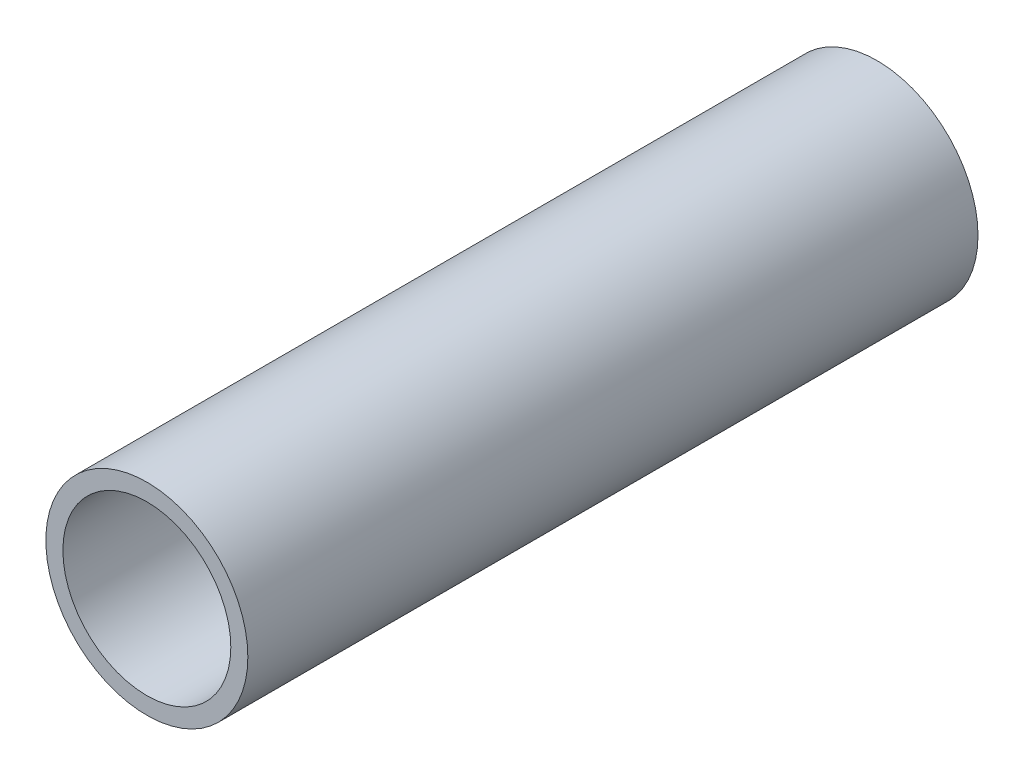
ISO-10303-21;
HEADER;
FILE_DESCRIPTION(('STEP AP214'),'2;1');
FILE_NAME('part.step','',(''),(''),'','','');
FILE_SCHEMA(('AUTOMOTIVE_DESIGN { 1 0 10303 214 1 1 1 1 }'));
ENDSEC;
DATA;
#1=APPLICATION_CONTEXT('core data for automotive mechanical design processes');
#2=APPLICATION_PROTOCOL_DEFINITION('international standard','automotive_design',2000,#1);
#3=PRODUCT_CONTEXT('',#1,'mechanical');
#4=PRODUCT('Part','Part','',(#3));
#5=PRODUCT_RELATED_PRODUCT_CATEGORY('part','',(#4));
#6=PRODUCT_DEFINITION_FORMATION('','',#4);
#7=PRODUCT_DEFINITION_CONTEXT('part definition',#1,'design');
#8=PRODUCT_DEFINITION('design','',#6,#7);
#9=PRODUCT_DEFINITION_SHAPE('','',#8);
#10=(LENGTH_UNIT() NAMED_UNIT(*) SI_UNIT(.MILLI.,.METRE.));
#11=(NAMED_UNIT(*) PLANE_ANGLE_UNIT() SI_UNIT($,.RADIAN.));
#12=(NAMED_UNIT(*) SI_UNIT($,.STERADIAN.) SOLID_ANGLE_UNIT());
#13=UNCERTAINTY_MEASURE_WITH_UNIT(LENGTH_MEASURE(1.E-05),#10,'distance_accuracy_value','');
#14=(GEOMETRIC_REPRESENTATION_CONTEXT(3) GLOBAL_UNCERTAINTY_ASSIGNED_CONTEXT((#13)) GLOBAL_UNIT_ASSIGNED_CONTEXT((#10,
#11,#12)) REPRESENTATION_CONTEXT('',''));
#15=CARTESIAN_POINT('',(0.,0.,0.));
#16=DIRECTION('',(0.,0.,1.));
#17=DIRECTION('',(1.,0.,0.));
#18=AXIS2_PLACEMENT_3D('',#15,#16,#17);
#19=CARTESIAN_POINT('',(0.,0.,152.4));
#20=DIRECTION('',(0.,0.,-1.));
#21=DIRECTION('',(-1.,0.,0.));
#22=AXIS2_PLACEMENT_3D('',#19,#20,#21);
#23=CYLINDRICAL_SURFACE('',#22,17.526);
#24=CARTESIAN_POINT('',(0.,0.,152.4));
#25=DIRECTION('',(0.,0.,1.));
#26=DIRECTION('',(1.,0.,0.));
#27=AXIS2_PLACEMENT_3D('',#24,#25,#26);
#28=CIRCLE('',#27,17.526);
#29=CARTESIAN_POINT('',(17.526,0.,152.4));
#30=VERTEX_POINT('',#29);
#31=EDGE_CURVE('E20',#30,#30,#28,.T.);
#32=ORIENTED_EDGE('',*,*,#31,.T.);
#33=EDGE_LOOP('',(#32));
#34=FACE_BOUND('',#33,.T.);
#35=CARTESIAN_POINT('',(0.,0.,0.));
#36=DIRECTION('',(0.,0.,1.));
#37=DIRECTION('',(1.,0.,0.));
#38=AXIS2_PLACEMENT_3D('',#35,#36,#37);
#39=CIRCLE('',#38,17.526);
#40=CARTESIAN_POINT('',(17.526,0.,0.));
#41=VERTEX_POINT('',#40);
#42=EDGE_CURVE('E31',#41,#41,#39,.T.);
#43=ORIENTED_EDGE('',*,*,#42,.F.);
#44=EDGE_LOOP('',(#43));
#45=FACE_BOUND('',#44,.T.);
#46=ADVANCED_FACE('F12',(#34,#45),#23,.F.);
#47=CARTESIAN_POINT('',(0.,0.,152.4));
#48=DIRECTION('',(0.,0.,-1.));
#49=DIRECTION('',(-1.,0.,0.));
#50=AXIS2_PLACEMENT_3D('',#47,#48,#49);
#51=CYLINDRICAL_SURFACE('',#50,21.082);
#52=CARTESIAN_POINT('',(0.,0.,152.4));
#53=DIRECTION('',(0.,0.,1.));
#54=DIRECTION('',(1.,0.,0.));
#55=AXIS2_PLACEMENT_3D('',#52,#53,#54);
#56=CIRCLE('',#55,21.082);
#57=CARTESIAN_POINT('',(21.082,0.,152.4));
#58=VERTEX_POINT('',#57);
#59=EDGE_CURVE('E8',#58,#58,#56,.T.);
#60=ORIENTED_EDGE('',*,*,#59,.F.);
#61=EDGE_LOOP('',(#60));
#62=FACE_BOUND('',#61,.T.);
#63=CARTESIAN_POINT('',(0.,0.,0.));
#64=DIRECTION('',(0.,0.,1.));
#65=DIRECTION('',(1.,0.,0.));
#66=AXIS2_PLACEMENT_3D('',#63,#64,#65);
#67=CIRCLE('',#66,21.082);
#68=CARTESIAN_POINT('',(21.082,0.,0.));
#69=VERTEX_POINT('',#68);
#70=EDGE_CURVE('E15',#69,#69,#67,.T.);
#71=ORIENTED_EDGE('',*,*,#70,.T.);
#72=EDGE_LOOP('',(#71));
#73=FACE_BOUND('',#72,.T.);
#74=ADVANCED_FACE('F40',(#62,#73),#51,.T.);
#75=CARTESIAN_POINT('',(-50.8,0.,152.4));
#76=DIRECTION('',(0.,0.,1.));
#77=DIRECTION('',(1.,0.,0.));
#78=AXIS2_PLACEMENT_3D('',#75,#76,#77);
#79=PLANE('',#78);
#80=ORIENTED_EDGE('',*,*,#31,.F.);
#81=EDGE_LOOP('',(#80));
#82=FACE_BOUND('',#81,.T.);
#83=ORIENTED_EDGE('',*,*,#59,.T.);
#84=EDGE_LOOP('',(#83));
#85=FACE_BOUND('',#84,.T.);
#86=ADVANCED_FACE('F44',(#82,#85),#79,.T.);
#87=CARTESIAN_POINT('',(-50.8,0.,0.));
#88=DIRECTION('',(0.,0.,1.));
#89=DIRECTION('',(1.,0.,0.));
#90=AXIS2_PLACEMENT_3D('',#87,#88,#89);
#91=PLANE('',#90);
#92=ORIENTED_EDGE('',*,*,#42,.T.);
#93=EDGE_LOOP('',(#92));
#94=FACE_BOUND('',#93,.T.);
#95=ORIENTED_EDGE('',*,*,#70,.F.);
#96=EDGE_LOOP('',(#95));
#97=FACE_BOUND('',#96,.T.);
#98=ADVANCED_FACE('F42',(#94,#97),#91,.F.);
#99=CLOSED_SHELL('',(#46,#74,#86,#98));
#100=MANIFOLD_SOLID_BREP('B1',#99);
#101=ADVANCED_BREP_SHAPE_REPRESENTATION('',(#18,#100),#14);
#102=SHAPE_DEFINITION_REPRESENTATION(#9,#101);
ENDSEC;
END-ISO-10303-21;
